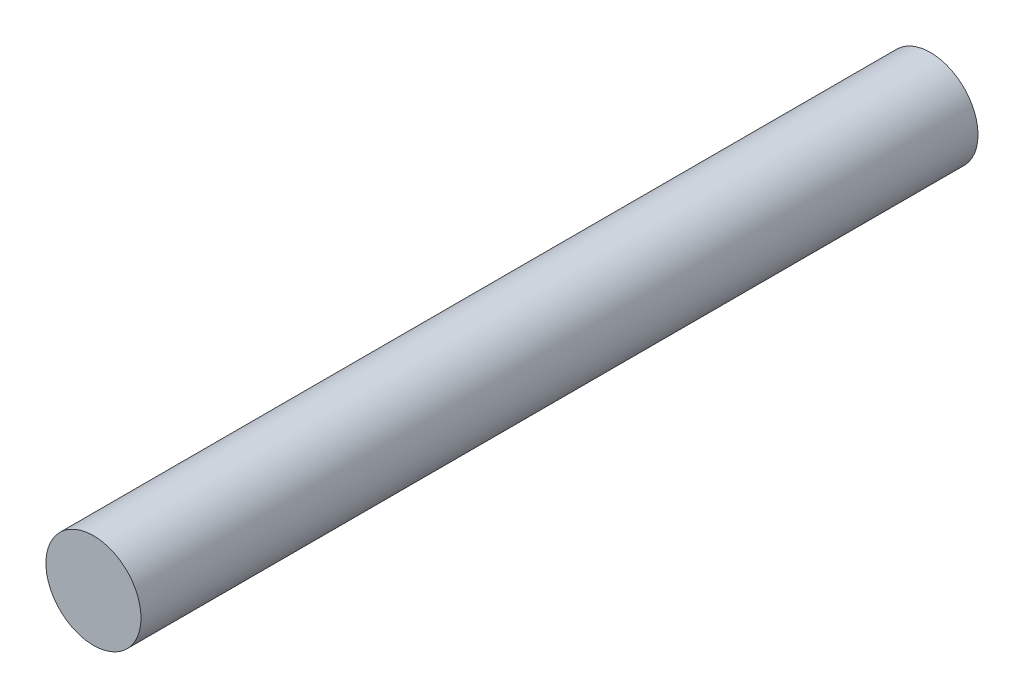
ISO-10303-21;
HEADER;
FILE_DESCRIPTION(('STEP AP214'),'2;1');
FILE_NAME('part.step','',(''),(''),'','','');
FILE_SCHEMA(('AUTOMOTIVE_DESIGN { 1 0 10303 214 1 1 1 1 }'));
ENDSEC;
DATA;
#1=APPLICATION_CONTEXT('core data for automotive mechanical design processes');
#2=APPLICATION_PROTOCOL_DEFINITION('international standard','automotive_design',2000,#1);
#3=PRODUCT_CONTEXT('',#1,'mechanical');
#4=PRODUCT('Part','Part','',(#3));
#5=PRODUCT_RELATED_PRODUCT_CATEGORY('part','',(#4));
#6=PRODUCT_DEFINITION_FORMATION('','',#4);
#7=PRODUCT_DEFINITION_CONTEXT('part definition',#1,'design');
#8=PRODUCT_DEFINITION('design','',#6,#7);
#9=PRODUCT_DEFINITION_SHAPE('','',#8);
#10=(LENGTH_UNIT() NAMED_UNIT(*) SI_UNIT(.MILLI.,.METRE.));
#11=(NAMED_UNIT(*) PLANE_ANGLE_UNIT() SI_UNIT($,.RADIAN.));
#12=(NAMED_UNIT(*) SI_UNIT($,.STERADIAN.) SOLID_ANGLE_UNIT());
#13=UNCERTAINTY_MEASURE_WITH_UNIT(LENGTH_MEASURE(1.E-05),#10,'distance_accuracy_value','');
#14=(GEOMETRIC_REPRESENTATION_CONTEXT(3) GLOBAL_UNCERTAINTY_ASSIGNED_CONTEXT((#13)) GLOBAL_UNIT_ASSIGNED_CONTEXT((#10,
#11,#12)) REPRESENTATION_CONTEXT('',''));
#15=CARTESIAN_POINT('',(0.,0.,0.));
#16=DIRECTION('',(0.,0.,1.));
#17=DIRECTION('',(1.,0.,0.));
#18=AXIS2_PLACEMENT_3D('',#15,#16,#17);
#19=CARTESIAN_POINT('',(0.,0.,35.6051280605346));
#20=DIRECTION('',(0.,0.,-1.));
#21=DIRECTION('',(-1.,0.,0.));
#22=AXIS2_PLACEMENT_3D('',#19,#20,#21);
#23=CYLINDRICAL_SURFACE('',#22,1.5875);
#24=CARTESIAN_POINT('',(0.,0.,0.));
#25=DIRECTION('',(0.,0.,1.));
#26=DIRECTION('',(1.,0.,0.));
#27=AXIS2_PLACEMENT_3D('',#24,#25,#26);
#28=CIRCLE('',#27,1.5875);
#29=CARTESIAN_POINT('',(1.5875,0.,0.));
#30=VERTEX_POINT('',#29);
#31=EDGE_CURVE('E38',#30,#30,#28,.T.);
#32=ORIENTED_EDGE('',*,*,#31,.T.);
#33=EDGE_LOOP('',(#32));
#34=FACE_BOUND('',#33,.T.);
#35=CARTESIAN_POINT('',(0.,0.,27.94));
#36=DIRECTION('',(0.,0.,1.));
#37=DIRECTION('',(1.,0.,0.));
#38=AXIS2_PLACEMENT_3D('',#35,#36,#37);
#39=CIRCLE('',#38,1.5875);
#40=CARTESIAN_POINT('',(1.5875,0.,27.94));
#41=VERTEX_POINT('',#40);
#42=EDGE_CURVE('E10',#41,#41,#39,.T.);
#43=ORIENTED_EDGE('',*,*,#42,.F.);
#44=EDGE_LOOP('',(#43));
#45=FACE_BOUND('',#44,.T.);
#46=ADVANCED_FACE('F31',(#34,#45),#23,.T.);
#47=CARTESIAN_POINT('',(0.,0.,0.));
#48=DIRECTION('',(0.,0.,1.));
#49=DIRECTION('',(1.,0.,0.));
#50=AXIS2_PLACEMENT_3D('',#47,#48,#49);
#51=PLANE('',#50);
#52=ORIENTED_EDGE('',*,*,#31,.F.);
#53=EDGE_LOOP('',(#52));
#54=FACE_BOUND('',#53,.T.);
#55=ADVANCED_FACE('F46',(#54),#51,.F.);
#56=CARTESIAN_POINT('',(0.,0.,27.94));
#57=DIRECTION('',(0.,0.,1.));
#58=DIRECTION('',(1.,0.,0.));
#59=AXIS2_PLACEMENT_3D('',#56,#57,#58);
#60=PLANE('',#59);
#61=ORIENTED_EDGE('',*,*,#42,.T.);
#62=EDGE_LOOP('',(#61));
#63=FACE_BOUND('',#62,.T.);
#64=ADVANCED_FACE('F33',(#63),#60,.T.);
#65=CLOSED_SHELL('',(#46,#55,#64));
#66=MANIFOLD_SOLID_BREP('B2',#65);
#67=ADVANCED_BREP_SHAPE_REPRESENTATION('',(#18,#66),#14);
#68=SHAPE_DEFINITION_REPRESENTATION(#9,#67);
ENDSEC;
END-ISO-10303-21;
